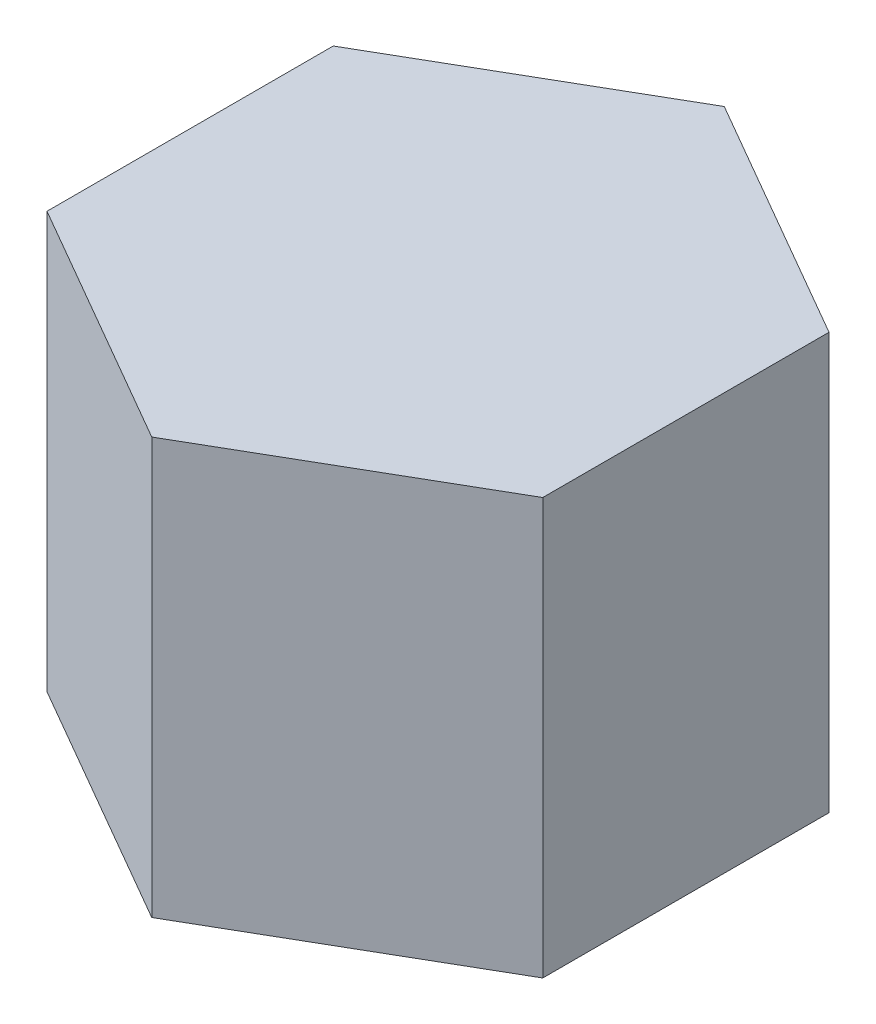
ISO-10303-21;
HEADER;
FILE_DESCRIPTION(('STEP AP214'),'2;1');
FILE_NAME('part.step','',(''),(''),'','','');
FILE_SCHEMA(('AUTOMOTIVE_DESIGN { 1 0 10303 214 1 1 1 1 }'));
ENDSEC;
DATA;
#1=APPLICATION_CONTEXT('core data for automotive mechanical design processes');
#2=APPLICATION_PROTOCOL_DEFINITION('international standard','automotive_design',2000,#1);
#3=PRODUCT_CONTEXT('',#1,'mechanical');
#4=PRODUCT('Part','Part','',(#3));
#5=PRODUCT_RELATED_PRODUCT_CATEGORY('part','',(#4));
#6=PRODUCT_DEFINITION_FORMATION('','',#4);
#7=PRODUCT_DEFINITION_CONTEXT('part definition',#1,'design');
#8=PRODUCT_DEFINITION('design','',#6,#7);
#9=PRODUCT_DEFINITION_SHAPE('','',#8);
#10=(LENGTH_UNIT() NAMED_UNIT(*) SI_UNIT(.MILLI.,.METRE.));
#11=(NAMED_UNIT(*) PLANE_ANGLE_UNIT() SI_UNIT($,.RADIAN.));
#12=(NAMED_UNIT(*) SI_UNIT($,.STERADIAN.) SOLID_ANGLE_UNIT());
#13=UNCERTAINTY_MEASURE_WITH_UNIT(LENGTH_MEASURE(1.E-05),#10,'distance_accuracy_value','');
#14=(GEOMETRIC_REPRESENTATION_CONTEXT(3) GLOBAL_UNCERTAINTY_ASSIGNED_CONTEXT((#13)) GLOBAL_UNIT_ASSIGNED_CONTEXT((#10,
#11,#12)) REPRESENTATION_CONTEXT('',''));
#15=CARTESIAN_POINT('',(0.,0.,0.));
#16=DIRECTION('',(0.,0.,1.));
#17=DIRECTION('',(1.,0.,0.));
#18=AXIS2_PLACEMENT_3D('',#15,#16,#17);
#19=CARTESIAN_POINT('',(202.839551417382,-147.556598747966,294.280047431848));
#20=DIRECTION('',(-0.500000000000096,0.,-0.866025403784383));
#21=DIRECTION('',(-0.866025403784383,0.,0.500000000000096));
#22=AXIS2_PLACEMENT_3D('',#19,#20,#21);
#23=PLANE('',#22);
#24=CARTESIAN_POINT('',(203.142660308706,-147.047793579175,294.105047431848));
#25=DIRECTION('',(-0.866025403784383,0.,0.500000000000096));
#26=VECTOR('',#25,1.);
#27=LINE('',#24,#26);
#28=CARTESIAN_POINT('',(203.142660308706,-147.047793579175,294.105047431848));
#29=VERTEX_POINT('',#28);
#30=CARTESIAN_POINT('',(202.839551417382,-147.047793579175,294.280047431848));
#31=VERTEX_POINT('',#30);
#32=EDGE_CURVE('E170',#29,#31,#27,.T.);
#33=ORIENTED_EDGE('',*,*,#32,.T.);
#34=CARTESIAN_POINT('',(202.839551417382,-147.556598747966,294.280047431848));
#35=DIRECTION('',(0.,1.,0.));
#36=VECTOR('',#35,1.);
#37=LINE('',#34,#36);
#38=CARTESIAN_POINT('',(202.839551417382,-147.556598747966,294.280047431848));
#39=VERTEX_POINT('',#38);
#40=EDGE_CURVE('E35',#39,#31,#37,.T.);
#41=ORIENTED_EDGE('',*,*,#40,.F.);
#42=CARTESIAN_POINT('',(203.142660308706,-147.556598747966,294.105047431848));
#43=DIRECTION('',(-0.866025403784383,0.,0.500000000000096));
#44=VECTOR('',#43,1.);
#45=LINE('',#42,#44);
#46=CARTESIAN_POINT('',(203.142660308706,-147.556598747966,294.105047431848));
#47=VERTEX_POINT('',#46);
#48=EDGE_CURVE('E159',#47,#39,#45,.T.);
#49=ORIENTED_EDGE('',*,*,#48,.F.);
#50=CARTESIAN_POINT('',(203.142660308706,-147.556598747966,294.105047431848));
#51=DIRECTION('',(0.,1.,0.));
#52=VECTOR('',#51,1.);
#53=LINE('',#50,#52);
#54=EDGE_CURVE('E10',#47,#29,#53,.T.);
#55=ORIENTED_EDGE('',*,*,#54,.T.);
#56=EDGE_LOOP('',(#33,#41,#49,#55));
#57=FACE_BOUND('',#56,.T.);
#58=ADVANCED_FACE('F16',(#57),#23,.F.);
#59=CARTESIAN_POINT('',(203.142660308706,-147.556598747966,291.594471220494));
#60=DIRECTION('',(-1.,0.,0.));
#61=DIRECTION('',(0.,-1.,0.));
#62=AXIS2_PLACEMENT_3D('',#59,#60,#61);
#63=PLANE('',#62);
#64=CARTESIAN_POINT('',(203.142660308706,-147.047793579175,293.755047431848));
#65=DIRECTION('',(0.,0.,1.));
#66=VECTOR('',#65,1.);
#67=LINE('',#64,#66);
#68=CARTESIAN_POINT('',(203.142660308706,-147.047793579175,293.755047431848));
#69=VERTEX_POINT('',#68);
#70=EDGE_CURVE('E167',#69,#29,#67,.T.);
#71=ORIENTED_EDGE('',*,*,#70,.T.);
#72=ORIENTED_EDGE('',*,*,#54,.F.);
#73=CARTESIAN_POINT('',(203.142660308706,-147.556598747966,293.755047431848));
#74=DIRECTION('',(0.,0.,1.));
#75=VECTOR('',#74,1.);
#76=LINE('',#73,#75);
#77=CARTESIAN_POINT('',(203.142660308706,-147.556598747966,293.755047431848));
#78=VERTEX_POINT('',#77);
#79=EDGE_CURVE('E156',#78,#47,#76,.T.);
#80=ORIENTED_EDGE('',*,*,#79,.F.);
#81=CARTESIAN_POINT('',(203.142660308706,-147.556598747966,293.755047431848));
#82=DIRECTION('',(0.,1.,0.));
#83=VECTOR('',#82,1.);
#84=LINE('',#81,#83);
#85=EDGE_CURVE('E27',#78,#69,#84,.T.);
#86=ORIENTED_EDGE('',*,*,#85,.T.);
#87=EDGE_LOOP('',(#71,#72,#80,#86));
#88=FACE_BOUND('',#87,.T.);
#89=ADVANCED_FACE('F189',(#88),#63,.F.);
#90=CARTESIAN_POINT('',(203.142660308706,-147.556598747966,293.755047431848));
#91=DIRECTION('',(-0.499999999999943,0.,0.866025403784471));
#92=DIRECTION('',(0.866025403784471,0.,0.499999999999943));
#93=AXIS2_PLACEMENT_3D('',#90,#91,#92);
#94=PLANE('',#93);
#95=CARTESIAN_POINT('',(202.839551417382,-147.047793579175,293.580047431848));
#96=DIRECTION('',(0.866025403784471,0.,0.499999999999943));
#97=VECTOR('',#96,1.);
#98=LINE('',#95,#97);
#99=CARTESIAN_POINT('',(202.839551417382,-147.047793579175,293.580047431848));
#100=VERTEX_POINT('',#99);
#101=EDGE_CURVE('E163',#100,#69,#98,.T.);
#102=ORIENTED_EDGE('',*,*,#101,.T.);
#103=ORIENTED_EDGE('',*,*,#85,.F.);
#104=CARTESIAN_POINT('',(202.839551417382,-147.556598747966,293.580047431848));
#105=DIRECTION('',(0.866025403784471,0.,0.499999999999943));
#106=VECTOR('',#105,1.);
#107=LINE('',#104,#106);
#108=CARTESIAN_POINT('',(202.839551417382,-147.556598747966,293.580047431848));
#109=VERTEX_POINT('',#108);
#110=EDGE_CURVE('E106',#109,#78,#107,.T.);
#111=ORIENTED_EDGE('',*,*,#110,.F.);
#112=CARTESIAN_POINT('',(202.839551417382,-147.556598747966,293.580047431848));
#113=DIRECTION('',(0.,1.,0.));
#114=VECTOR('',#113,1.);
#115=LINE('',#112,#114);
#116=EDGE_CURVE('E94',#109,#100,#115,.T.);
#117=ORIENTED_EDGE('',*,*,#116,.T.);
#118=EDGE_LOOP('',(#102,#103,#111,#117));
#119=FACE_BOUND('',#118,.T.);
#120=ADVANCED_FACE('F198',(#119),#94,.F.);
#121=CARTESIAN_POINT('',(202.839551417382,-147.556598747966,293.580047431848));
#122=DIRECTION('',(0.499999999999978,0.,0.866025403784452));
#123=DIRECTION('',(0.866025403784452,0.,-0.499999999999978));
#124=AXIS2_PLACEMENT_3D('',#121,#122,#123);
#125=PLANE('',#124);
#126=CARTESIAN_POINT('',(202.536442526057,-147.047793579175,293.755047431848));
#127=DIRECTION('',(0.866025403784452,0.,-0.499999999999978));
#128=VECTOR('',#127,1.);
#129=LINE('',#126,#128);
#130=CARTESIAN_POINT('',(202.536442526057,-147.047793579175,293.755047431848));
#131=VERTEX_POINT('',#130);
#132=EDGE_CURVE('E162',#131,#100,#129,.T.);
#133=ORIENTED_EDGE('',*,*,#132,.T.);
#134=ORIENTED_EDGE('',*,*,#116,.F.);
#135=CARTESIAN_POINT('',(202.536442526057,-147.556598747966,293.755047431848));
#136=DIRECTION('',(0.866025403784452,0.,-0.499999999999978));
#137=VECTOR('',#136,1.);
#138=LINE('',#135,#137);
#139=CARTESIAN_POINT('',(202.536442526057,-147.556598747966,293.755047431848));
#140=VERTEX_POINT('',#139);
#141=EDGE_CURVE('E98',#140,#109,#138,.T.);
#142=ORIENTED_EDGE('',*,*,#141,.F.);
#143=CARTESIAN_POINT('',(202.536442526057,-147.556598747966,293.755047431848));
#144=DIRECTION('',(0.,1.,0.));
#145=VECTOR('',#144,1.);
#146=LINE('',#143,#145);
#147=EDGE_CURVE('E79',#140,#131,#146,.T.);
#148=ORIENTED_EDGE('',*,*,#147,.T.);
#149=EDGE_LOOP('',(#133,#134,#142,#148));
#150=FACE_BOUND('',#149,.T.);
#151=ADVANCED_FACE('F100',(#150),#125,.F.);
#152=CARTESIAN_POINT('',(202.536442526057,-147.556598747966,291.594471220494));
#153=DIRECTION('',(1.,0.,0.));
#154=DIRECTION('',(0.,1.,0.));
#155=AXIS2_PLACEMENT_3D('',#152,#153,#154);
#156=PLANE('',#155);
#157=CARTESIAN_POINT('',(202.536442526057,-147.047793579175,294.105047431848));
#158=DIRECTION('',(0.,0.,-1.));
#159=VECTOR('',#158,1.);
#160=LINE('',#157,#159);
#161=CARTESIAN_POINT('',(202.536442526057,-147.047793579175,294.105047431848));
#162=VERTEX_POINT('',#161);
#163=EDGE_CURVE('E88',#162,#131,#160,.T.);
#164=ORIENTED_EDGE('',*,*,#163,.T.);
#165=ORIENTED_EDGE('',*,*,#147,.F.);
#166=CARTESIAN_POINT('',(202.536442526057,-147.556598747966,294.105047431848));
#167=DIRECTION('',(0.,0.,-1.));
#168=VECTOR('',#167,1.);
#169=LINE('',#166,#168);
#170=CARTESIAN_POINT('',(202.536442526057,-147.556598747966,294.105047431848));
#171=VERTEX_POINT('',#170);
#172=EDGE_CURVE('E84',#171,#140,#169,.T.);
#173=ORIENTED_EDGE('',*,*,#172,.F.);
#174=CARTESIAN_POINT('',(202.536442526057,-147.556598747966,294.105047431848));
#175=DIRECTION('',(0.,1.,0.));
#176=VECTOR('',#175,1.);
#177=LINE('',#174,#176);
#178=EDGE_CURVE('E58',#171,#162,#177,.T.);
#179=ORIENTED_EDGE('',*,*,#178,.T.);
#180=EDGE_LOOP('',(#164,#165,#173,#179));
#181=FACE_BOUND('',#180,.T.);
#182=ADVANCED_FACE('F82',(#181),#156,.F.);
#183=CARTESIAN_POINT('',(202.536442526057,-147.556598747966,294.105047431848));
#184=DIRECTION('',(0.499999999999978,0.,-0.866025403784452));
#185=DIRECTION('',(-0.866025403784452,0.,-0.499999999999978));
#186=AXIS2_PLACEMENT_3D('',#183,#184,#185);
#187=PLANE('',#186);
#188=CARTESIAN_POINT('',(202.839551417382,-147.047793579175,294.280047431848));
#189=DIRECTION('',(-0.866025403784452,0.,-0.499999999999978));
#190=VECTOR('',#189,1.);
#191=LINE('',#188,#190);
#192=EDGE_CURVE('E160',#31,#162,#191,.T.);
#193=ORIENTED_EDGE('',*,*,#192,.T.);
#194=ORIENTED_EDGE('',*,*,#178,.F.);
#195=CARTESIAN_POINT('',(202.839551417382,-147.556598747966,294.280047431848));
#196=DIRECTION('',(-0.866025403784452,0.,-0.499999999999978));
#197=VECTOR('',#196,1.);
#198=LINE('',#195,#197);
#199=EDGE_CURVE('E112',#39,#171,#198,.T.);
#200=ORIENTED_EDGE('',*,*,#199,.F.);
#201=ORIENTED_EDGE('',*,*,#40,.T.);
#202=EDGE_LOOP('',(#193,#194,#200,#201));
#203=FACE_BOUND('',#202,.T.);
#204=ADVANCED_FACE('F131',(#203),#187,.F.);
#205=CARTESIAN_POINT('',(206.491105863044,-147.556598747966,291.594471220494));
#206=DIRECTION('',(0.,1.,0.));
#207=DIRECTION('',(-1.,0.,0.));
#208=AXIS2_PLACEMENT_3D('',#205,#206,#207);
#209=PLANE('',#208);
#210=ORIENTED_EDGE('',*,*,#48,.T.);
#211=ORIENTED_EDGE('',*,*,#199,.T.);
#212=ORIENTED_EDGE('',*,*,#172,.T.);
#213=ORIENTED_EDGE('',*,*,#141,.T.);
#214=ORIENTED_EDGE('',*,*,#110,.T.);
#215=ORIENTED_EDGE('',*,*,#79,.T.);
#216=EDGE_LOOP('',(#210,#211,#212,#213,#214,#215));
#217=FACE_BOUND('',#216,.T.);
#218=ADVANCED_FACE('F111',(#217),#209,.F.);
#219=CARTESIAN_POINT('',(206.491105863044,-147.047793579175,291.594471220494));
#220=DIRECTION('',(0.,1.,0.));
#221=DIRECTION('',(-1.,0.,0.));
#222=AXIS2_PLACEMENT_3D('',#219,#220,#221);
#223=PLANE('',#222);
#224=ORIENTED_EDGE('',*,*,#32,.F.);
#225=ORIENTED_EDGE('',*,*,#70,.F.);
#226=ORIENTED_EDGE('',*,*,#101,.F.);
#227=ORIENTED_EDGE('',*,*,#132,.F.);
#228=ORIENTED_EDGE('',*,*,#163,.F.);
#229=ORIENTED_EDGE('',*,*,#192,.F.);
#230=EDGE_LOOP('',(#224,#225,#226,#227,#228,#229));
#231=FACE_BOUND('',#230,.T.);
#232=ADVANCED_FACE('F130',(#231),#223,.T.);
#233=CLOSED_SHELL('',(#58,#89,#120,#151,#182,#204,#218,#232));
#234=MANIFOLD_SOLID_BREP('B1',#233);
#235=ADVANCED_BREP_SHAPE_REPRESENTATION('',(#18,#234),#14);
#236=SHAPE_DEFINITION_REPRESENTATION(#9,#235);
ENDSEC;
END-ISO-10303-21;
